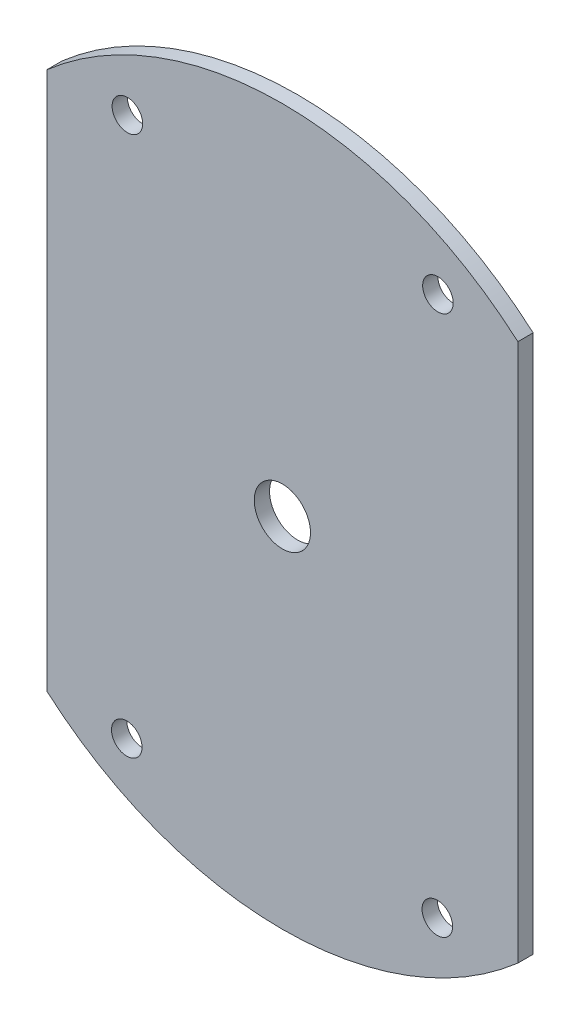
ISO-10303-21;
HEADER;
FILE_DESCRIPTION(('STEP AP214'),'2;1');
FILE_NAME('part.step','',(''),(''),'','','');
FILE_SCHEMA(('AUTOMOTIVE_DESIGN { 1 0 10303 214 1 1 1 1 }'));
ENDSEC;
DATA;
#1=APPLICATION_CONTEXT('core data for automotive mechanical design processes');
#2=APPLICATION_PROTOCOL_DEFINITION('international standard','automotive_design',2000,#1);
#3=PRODUCT_CONTEXT('',#1,'mechanical');
#4=PRODUCT('Part','Part','',(#3));
#5=PRODUCT_RELATED_PRODUCT_CATEGORY('part','',(#4));
#6=PRODUCT_DEFINITION_FORMATION('','',#4);
#7=PRODUCT_DEFINITION_CONTEXT('part definition',#1,'design');
#8=PRODUCT_DEFINITION('design','',#6,#7);
#9=PRODUCT_DEFINITION_SHAPE('','',#8);
#10=(LENGTH_UNIT() NAMED_UNIT(*) SI_UNIT(.MILLI.,.METRE.));
#11=(NAMED_UNIT(*) PLANE_ANGLE_UNIT() SI_UNIT($,.RADIAN.));
#12=(NAMED_UNIT(*) SI_UNIT($,.STERADIAN.) SOLID_ANGLE_UNIT());
#13=UNCERTAINTY_MEASURE_WITH_UNIT(LENGTH_MEASURE(1.E-05),#10,'distance_accuracy_value','');
#14=(GEOMETRIC_REPRESENTATION_CONTEXT(3) GLOBAL_UNCERTAINTY_ASSIGNED_CONTEXT((#13)) GLOBAL_UNIT_ASSIGNED_CONTEXT((#10,
#11,#12)) REPRESENTATION_CONTEXT('',''));
#15=CARTESIAN_POINT('',(0.,0.,0.));
#16=DIRECTION('',(0.,0.,1.));
#17=DIRECTION('',(1.,0.,0.));
#18=AXIS2_PLACEMENT_3D('',#15,#16,#17);
#19=CARTESIAN_POINT('',(0.,0.,3.175));
#20=DIRECTION('',(0.,0.,-1.));
#21=DIRECTION('',(-1.,0.,0.));
#22=AXIS2_PLACEMENT_3D('',#19,#20,#21);
#23=CYLINDRICAL_SURFACE('',#22,74.295);
#24=CARTESIAN_POINT('',(0.,0.,3.175));
#25=DIRECTION('',(0.,0.,1.));
#26=DIRECTION('',(1.,0.,0.));
#27=AXIS2_PLACEMENT_3D('',#24,#25,#26);
#28=CIRCLE('',#27,74.295);
#29=CARTESIAN_POINT('',(-48.9302022942517,-55.9069076988131,3.175));
#30=VERTEX_POINT('',#29);
#31=CARTESIAN_POINT('',(48.9302022942517,-55.9069076988131,3.175));
#32=VERTEX_POINT('',#31);
#33=EDGE_CURVE('E52',#30,#32,#28,.T.);
#34=ORIENTED_EDGE('',*,*,#33,.F.);
#35=DIRECTION('',(0.,0.,1.));
#36=VECTOR('',#35,1.);
#37=CARTESIAN_POINT('',(-48.9302022942517,-55.9069076988131,0.));
#38=LINE('',#37,#36);
#39=CARTESIAN_POINT('',(-48.9302022942517,-55.9069076988131,0.));
#40=VERTEX_POINT('',#39);
#41=EDGE_CURVE('E86',#40,#30,#38,.T.);
#42=ORIENTED_EDGE('',*,*,#41,.F.);
#43=CARTESIAN_POINT('',(0.,0.,0.));
#44=DIRECTION('',(0.,0.,1.));
#45=DIRECTION('',(1.,0.,0.));
#46=AXIS2_PLACEMENT_3D('',#43,#44,#45);
#47=CIRCLE('',#46,74.295);
#48=CARTESIAN_POINT('',(48.9302022942517,-55.9069076988131,0.));
#49=VERTEX_POINT('',#48);
#50=EDGE_CURVE('E96',#40,#49,#47,.T.);
#51=ORIENTED_EDGE('',*,*,#50,.T.);
#52=DIRECTION('',(0.,0.,1.));
#53=VECTOR('',#52,1.);
#54=CARTESIAN_POINT('',(48.9302022942517,-55.9069076988131,0.));
#55=LINE('',#54,#53);
#56=EDGE_CURVE('E139',#49,#32,#55,.T.);
#57=ORIENTED_EDGE('',*,*,#56,.T.);
#58=EDGE_LOOP('',(#34,#42,#51,#57));
#59=FACE_BOUND('',#58,.T.);
#60=ADVANCED_FACE('F43',(#59),#23,.T.);
#61=CARTESIAN_POINT('',(0.,0.,3.175));
#62=DIRECTION('',(0.,0.,1.));
#63=DIRECTION('',(1.,0.,0.));
#64=AXIS2_PLACEMENT_3D('',#61,#62,#63);
#65=PLANE('',#64);
#66=DIRECTION('',(0.,1.,0.));
#67=VECTOR('',#66,1.);
#68=CARTESIAN_POINT('',(-48.9302022942517,55.9069076988131,3.175));
#69=LINE('',#68,#67);
#70=CARTESIAN_POINT('',(-48.9302022942517,55.9069076988131,3.175));
#71=VERTEX_POINT('',#70);
#72=EDGE_CURVE('E67',#30,#71,#69,.T.);
#73=ORIENTED_EDGE('',*,*,#72,.F.);
#74=ORIENTED_EDGE('',*,*,#33,.T.);
#75=DIRECTION('',(0.,-1.,0.));
#76=VECTOR('',#75,1.);
#77=CARTESIAN_POINT('',(48.9302022942517,55.9069076988131,3.175));
#78=LINE('',#77,#76);
#79=CARTESIAN_POINT('',(48.9302022942517,55.9069076988131,3.175));
#80=VERTEX_POINT('',#79);
#81=EDGE_CURVE('E59',#80,#32,#78,.T.);
#82=ORIENTED_EDGE('',*,*,#81,.F.);
#83=EDGE_CURVE('E11',#80,#71,#28,.T.);
#84=ORIENTED_EDGE('',*,*,#83,.T.);
#85=EDGE_LOOP('',(#73,#74,#82,#84));
#86=FACE_BOUND('',#85,.T.);
#87=CARTESIAN_POINT('',(-32.3227392073649,-56.1283196630579,3.175));
#88=DIRECTION('',(0.,0.,1.));
#89=DIRECTION('',(1.,0.,0.));
#90=AXIS2_PLACEMENT_3D('',#87,#88,#89);
#91=CIRCLE('',#90,3.175);
#92=CARTESIAN_POINT('',(-29.1477392073649,-56.1283196630579,3.175));
#93=VERTEX_POINT('',#92);
#94=EDGE_CURVE('E122',#93,#93,#91,.T.);
#95=ORIENTED_EDGE('',*,*,#94,.F.);
#96=EDGE_LOOP('',(#95));
#97=FACE_BOUND('',#96,.T.);
#98=CARTESIAN_POINT('',(-32.1982176220948,56.1283196630579,3.175));
#99=DIRECTION('',(0.,0.,1.));
#100=DIRECTION('',(1.,0.,0.));
#101=AXIS2_PLACEMENT_3D('',#98,#99,#100);
#102=CIRCLE('',#101,3.175);
#103=CARTESIAN_POINT('',(-29.0232176220948,56.1283196630579,3.175));
#104=VERTEX_POINT('',#103);
#105=EDGE_CURVE('E110',#104,#104,#102,.T.);
#106=ORIENTED_EDGE('',*,*,#105,.F.);
#107=EDGE_LOOP('',(#106));
#108=FACE_BOUND('',#107,.T.);
#109=CARTESIAN_POINT('',(0.,0.,3.175));
#110=DIRECTION('',(0.,0.,1.));
#111=DIRECTION('',(1.,0.,0.));
#112=AXIS2_PLACEMENT_3D('',#109,#110,#111);
#113=CIRCLE('',#112,5.842);
#114=CARTESIAN_POINT('',(5.84200000000001,0.,3.175));
#115=VERTEX_POINT('',#114);
#116=EDGE_CURVE('E103',#115,#115,#113,.T.);
#117=ORIENTED_EDGE('',*,*,#116,.F.);
#118=EDGE_LOOP('',(#117));
#119=FACE_BOUND('',#118,.T.);
#120=CARTESIAN_POINT('',(32.3227392073649,56.1283196630579,3.175));
#121=DIRECTION('',(0.,0.,1.));
#122=DIRECTION('',(1.,0.,0.));
#123=AXIS2_PLACEMENT_3D('',#120,#121,#122);
#124=CIRCLE('',#123,3.175);
#125=CARTESIAN_POINT('',(35.4977392073649,56.1283196630579,3.175));
#126=VERTEX_POINT('',#125);
#127=EDGE_CURVE('E116',#126,#126,#124,.T.);
#128=ORIENTED_EDGE('',*,*,#127,.F.);
#129=EDGE_LOOP('',(#128));
#130=FACE_BOUND('',#129,.T.);
#131=CARTESIAN_POINT('',(32.1982176220948,-56.1283196630579,3.175));
#132=DIRECTION('',(0.,0.,1.));
#133=DIRECTION('',(1.,0.,0.));
#134=AXIS2_PLACEMENT_3D('',#131,#132,#133);
#135=CIRCLE('',#134,3.175);
#136=CARTESIAN_POINT('',(35.3732176220948,-56.1283196630579,3.175));
#137=VERTEX_POINT('',#136);
#138=EDGE_CURVE('E128',#137,#137,#135,.T.);
#139=ORIENTED_EDGE('',*,*,#138,.F.);
#140=EDGE_LOOP('',(#139));
#141=FACE_BOUND('',#140,.T.);
#142=ADVANCED_FACE('F147',(#86,#97,#108,#119,#130,#141),#65,.T.);
#143=CARTESIAN_POINT('',(0.,0.,0.));
#144=DIRECTION('',(0.,0.,1.));
#145=DIRECTION('',(1.,0.,0.));
#146=AXIS2_PLACEMENT_3D('',#143,#144,#145);
#147=PLANE('',#146);
#148=ORIENTED_EDGE('',*,*,#50,.F.);
#149=DIRECTION('',(0.,1.,0.));
#150=VECTOR('',#149,1.);
#151=CARTESIAN_POINT('',(-48.9302022942517,55.9069076988131,0.));
#152=LINE('',#151,#150);
#153=CARTESIAN_POINT('',(-48.9302022942517,55.9069076988131,0.));
#154=VERTEX_POINT('',#153);
#155=EDGE_CURVE('E83',#40,#154,#152,.T.);
#156=ORIENTED_EDGE('',*,*,#155,.T.);
#157=CARTESIAN_POINT('',(48.9302022942517,55.9069076988131,0.));
#158=VERTEX_POINT('',#157);
#159=EDGE_CURVE('E47',#158,#154,#47,.T.);
#160=ORIENTED_EDGE('',*,*,#159,.F.);
#161=DIRECTION('',(0.,-1.,0.));
#162=VECTOR('',#161,1.);
#163=CARTESIAN_POINT('',(48.9302022942517,55.9069076988131,0.));
#164=LINE('',#163,#162);
#165=EDGE_CURVE('E102',#158,#49,#164,.T.);
#166=ORIENTED_EDGE('',*,*,#165,.T.);
#167=EDGE_LOOP('',(#148,#156,#160,#166));
#168=FACE_BOUND('',#167,.T.);
#169=CARTESIAN_POINT('',(0.,0.,0.));
#170=DIRECTION('',(0.,0.,1.));
#171=DIRECTION('',(1.,0.,0.));
#172=AXIS2_PLACEMENT_3D('',#169,#170,#171);
#173=CIRCLE('',#172,5.842);
#174=CARTESIAN_POINT('',(5.84200000000001,0.,0.));
#175=VERTEX_POINT('',#174);
#176=EDGE_CURVE('E105',#175,#175,#173,.T.);
#177=ORIENTED_EDGE('',*,*,#176,.T.);
#178=EDGE_LOOP('',(#177));
#179=FACE_BOUND('',#178,.T.);
#180=CARTESIAN_POINT('',(-32.1982176220948,56.1283196630579,0.));
#181=DIRECTION('',(0.,0.,1.));
#182=DIRECTION('',(1.,0.,0.));
#183=AXIS2_PLACEMENT_3D('',#180,#181,#182);
#184=CIRCLE('',#183,3.175);
#185=CARTESIAN_POINT('',(-29.0232176220948,56.1283196630579,0.));
#186=VERTEX_POINT('',#185);
#187=EDGE_CURVE('E113',#186,#186,#184,.T.);
#188=ORIENTED_EDGE('',*,*,#187,.T.);
#189=EDGE_LOOP('',(#188));
#190=FACE_BOUND('',#189,.T.);
#191=CARTESIAN_POINT('',(32.3227392073649,56.1283196630579,0.));
#192=DIRECTION('',(0.,0.,1.));
#193=DIRECTION('',(1.,0.,0.));
#194=AXIS2_PLACEMENT_3D('',#191,#192,#193);
#195=CIRCLE('',#194,3.175);
#196=CARTESIAN_POINT('',(35.4977392073649,56.1283196630579,0.));
#197=VERTEX_POINT('',#196);
#198=EDGE_CURVE('E119',#197,#197,#195,.T.);
#199=ORIENTED_EDGE('',*,*,#198,.T.);
#200=EDGE_LOOP('',(#199));
#201=FACE_BOUND('',#200,.T.);
#202=CARTESIAN_POINT('',(-32.3227392073649,-56.1283196630579,0.));
#203=DIRECTION('',(0.,0.,1.));
#204=DIRECTION('',(1.,0.,0.));
#205=AXIS2_PLACEMENT_3D('',#202,#203,#204);
#206=CIRCLE('',#205,3.175);
#207=CARTESIAN_POINT('',(-29.1477392073649,-56.1283196630579,0.));
#208=VERTEX_POINT('',#207);
#209=EDGE_CURVE('E125',#208,#208,#206,.T.);
#210=ORIENTED_EDGE('',*,*,#209,.T.);
#211=EDGE_LOOP('',(#210));
#212=FACE_BOUND('',#211,.T.);
#213=CARTESIAN_POINT('',(32.1982176220948,-56.1283196630579,0.));
#214=DIRECTION('',(0.,0.,1.));
#215=DIRECTION('',(1.,0.,0.));
#216=AXIS2_PLACEMENT_3D('',#213,#214,#215);
#217=CIRCLE('',#216,3.175);
#218=CARTESIAN_POINT('',(35.3732176220948,-56.1283196630579,0.));
#219=VERTEX_POINT('',#218);
#220=EDGE_CURVE('E131',#219,#219,#217,.T.);
#221=ORIENTED_EDGE('',*,*,#220,.T.);
#222=EDGE_LOOP('',(#221));
#223=FACE_BOUND('',#222,.T.);
#224=ADVANCED_FACE('F100',(#168,#179,#190,#201,#212,#223),#147,.F.);
#225=ORIENTED_EDGE('',*,*,#159,.T.);
#226=DIRECTION('',(0.,0.,1.));
#227=VECTOR('',#226,1.);
#228=CARTESIAN_POINT('',(-48.9302022942517,55.9069076988131,0.));
#229=LINE('',#228,#227);
#230=EDGE_CURVE('E87',#154,#71,#229,.T.);
#231=ORIENTED_EDGE('',*,*,#230,.T.);
#232=ORIENTED_EDGE('',*,*,#83,.F.);
#233=DIRECTION('',(0.,0.,1.));
#234=VECTOR('',#233,1.);
#235=CARTESIAN_POINT('',(48.9302022942517,55.9069076988131,0.));
#236=LINE('',#235,#234);
#237=EDGE_CURVE('E137',#158,#80,#236,.T.);
#238=ORIENTED_EDGE('',*,*,#237,.F.);
#239=EDGE_LOOP('',(#225,#231,#232,#238));
#240=FACE_BOUND('',#239,.T.);
#241=ADVANCED_FACE('F45',(#240),#23,.T.);
#242=CARTESIAN_POINT('',(0.,0.,3.175));
#243=DIRECTION('',(0.,0.,-1.));
#244=DIRECTION('',(-1.,0.,0.));
#245=AXIS2_PLACEMENT_3D('',#242,#243,#244);
#246=CYLINDRICAL_SURFACE('',#245,5.842);
#247=ORIENTED_EDGE('',*,*,#116,.T.);
#248=EDGE_LOOP('',(#247));
#249=FACE_BOUND('',#248,.T.);
#250=ORIENTED_EDGE('',*,*,#176,.F.);
#251=EDGE_LOOP('',(#250));
#252=FACE_BOUND('',#251,.T.);
#253=ADVANCED_FACE('F172',(#249,#252),#246,.F.);
#254=CARTESIAN_POINT('',(-32.1982176220948,56.1283196630579,3.175));
#255=DIRECTION('',(0.,0.,-1.));
#256=DIRECTION('',(-1.,0.,0.));
#257=AXIS2_PLACEMENT_3D('',#254,#255,#256);
#258=CYLINDRICAL_SURFACE('',#257,3.175);
#259=ORIENTED_EDGE('',*,*,#105,.T.);
#260=EDGE_LOOP('',(#259));
#261=FACE_BOUND('',#260,.T.);
#262=ORIENTED_EDGE('',*,*,#187,.F.);
#263=EDGE_LOOP('',(#262));
#264=FACE_BOUND('',#263,.T.);
#265=ADVANCED_FACE('F206',(#261,#264),#258,.F.);
#266=CARTESIAN_POINT('',(32.3227392073649,56.1283196630579,3.175));
#267=DIRECTION('',(0.,0.,-1.));
#268=DIRECTION('',(-1.,0.,0.));
#269=AXIS2_PLACEMENT_3D('',#266,#267,#268);
#270=CYLINDRICAL_SURFACE('',#269,3.175);
#271=ORIENTED_EDGE('',*,*,#127,.T.);
#272=EDGE_LOOP('',(#271));
#273=FACE_BOUND('',#272,.T.);
#274=ORIENTED_EDGE('',*,*,#198,.F.);
#275=EDGE_LOOP('',(#274));
#276=FACE_BOUND('',#275,.T.);
#277=ADVANCED_FACE('F215',(#273,#276),#270,.F.);
#278=CARTESIAN_POINT('',(-32.3227392073649,-56.1283196630579,3.175));
#279=DIRECTION('',(0.,0.,-1.));
#280=DIRECTION('',(-1.,0.,0.));
#281=AXIS2_PLACEMENT_3D('',#278,#279,#280);
#282=CYLINDRICAL_SURFACE('',#281,3.175);
#283=ORIENTED_EDGE('',*,*,#94,.T.);
#284=EDGE_LOOP('',(#283));
#285=FACE_BOUND('',#284,.T.);
#286=ORIENTED_EDGE('',*,*,#209,.F.);
#287=EDGE_LOOP('',(#286));
#288=FACE_BOUND('',#287,.T.);
#289=ADVANCED_FACE('F164',(#285,#288),#282,.F.);
#290=CARTESIAN_POINT('',(32.1982176220948,-56.1283196630579,3.175));
#291=DIRECTION('',(0.,0.,-1.));
#292=DIRECTION('',(-1.,0.,0.));
#293=AXIS2_PLACEMENT_3D('',#290,#291,#292);
#294=CYLINDRICAL_SURFACE('',#293,3.175);
#295=ORIENTED_EDGE('',*,*,#138,.T.);
#296=EDGE_LOOP('',(#295));
#297=FACE_BOUND('',#296,.T.);
#298=ORIENTED_EDGE('',*,*,#220,.F.);
#299=EDGE_LOOP('',(#298));
#300=FACE_BOUND('',#299,.T.);
#301=ADVANCED_FACE('F160',(#297,#300),#294,.F.);
#302=CARTESIAN_POINT('',(48.9302022942517,55.9069076988131,0.));
#303=DIRECTION('',(-1.,0.,0.));
#304=DIRECTION('',(0.,0.,1.));
#305=AXIS2_PLACEMENT_3D('',#302,#303,#304);
#306=PLANE('',#305);
#307=ORIENTED_EDGE('',*,*,#81,.T.);
#308=ORIENTED_EDGE('',*,*,#56,.F.);
#309=ORIENTED_EDGE('',*,*,#165,.F.);
#310=ORIENTED_EDGE('',*,*,#237,.T.);
#311=EDGE_LOOP('',(#307,#308,#309,#310));
#312=FACE_BOUND('',#311,.T.);
#313=ADVANCED_FACE('F163',(#312),#306,.F.);
#314=CARTESIAN_POINT('',(-48.9302022942517,55.9069076988131,0.));
#315=DIRECTION('',(1.,0.,0.));
#316=DIRECTION('',(0.,0.,-1.));
#317=AXIS2_PLACEMENT_3D('',#314,#315,#316);
#318=PLANE('',#317);
#319=ORIENTED_EDGE('',*,*,#72,.T.);
#320=ORIENTED_EDGE('',*,*,#230,.F.);
#321=ORIENTED_EDGE('',*,*,#155,.F.);
#322=ORIENTED_EDGE('',*,*,#41,.T.);
#323=EDGE_LOOP('',(#319,#320,#321,#322));
#324=FACE_BOUND('',#323,.T.);
#325=ADVANCED_FACE('F85',(#324),#318,.F.);
#326=CLOSED_SHELL('',(#60,#142,#224,#241,#253,#265,#277,#289,#301,#313,#325));
#327=MANIFOLD_SOLID_BREP('B2',#326);
#328=ADVANCED_BREP_SHAPE_REPRESENTATION('',(#18,#327),#14);
#329=SHAPE_DEFINITION_REPRESENTATION(#9,#328);
ENDSEC;
END-ISO-10303-21;
